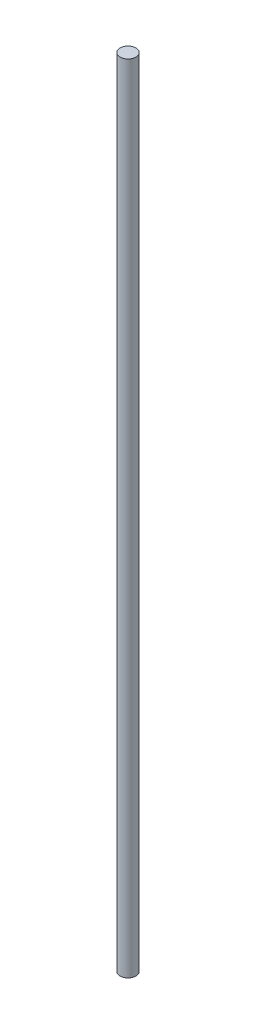
ISO-10303-21;
HEADER;
FILE_DESCRIPTION(('STEP AP214'),'2;1');
FILE_NAME('part.step','',(''),(''),'','','');
FILE_SCHEMA(('AUTOMOTIVE_DESIGN { 1 0 10303 214 1 1 1 1 }'));
ENDSEC;
DATA;
#1=APPLICATION_CONTEXT('core data for automotive mechanical design processes');
#2=APPLICATION_PROTOCOL_DEFINITION('international standard','automotive_design',2000,#1);
#3=PRODUCT_CONTEXT('',#1,'mechanical');
#4=PRODUCT('Part','Part','',(#3));
#5=PRODUCT_RELATED_PRODUCT_CATEGORY('part','',(#4));
#6=PRODUCT_DEFINITION_FORMATION('','',#4);
#7=PRODUCT_DEFINITION_CONTEXT('part definition',#1,'design');
#8=PRODUCT_DEFINITION('design','',#6,#7);
#9=PRODUCT_DEFINITION_SHAPE('','',#8);
#10=(LENGTH_UNIT() NAMED_UNIT(*) SI_UNIT(.MILLI.,.METRE.));
#11=(NAMED_UNIT(*) PLANE_ANGLE_UNIT() SI_UNIT($,.RADIAN.));
#12=(NAMED_UNIT(*) SI_UNIT($,.STERADIAN.) SOLID_ANGLE_UNIT());
#13=UNCERTAINTY_MEASURE_WITH_UNIT(LENGTH_MEASURE(1.E-05),#10,'distance_accuracy_value','');
#14=(GEOMETRIC_REPRESENTATION_CONTEXT(3) GLOBAL_UNCERTAINTY_ASSIGNED_CONTEXT((#13)) GLOBAL_UNIT_ASSIGNED_CONTEXT((#10,
#11,#12)) REPRESENTATION_CONTEXT('',''));
#15=CARTESIAN_POINT('',(0.,0.,0.));
#16=DIRECTION('',(0.,0.,1.));
#17=DIRECTION('',(1.,0.,0.));
#18=AXIS2_PLACEMENT_3D('',#15,#16,#17);
#19=CARTESIAN_POINT('',(0.,300.5,0.));
#20=DIRECTION('',(0.,-1.,0.));
#21=DIRECTION('',(0.,0.,-1.));
#22=AXIS2_PLACEMENT_3D('',#19,#20,#21);
#23=CYLINDRICAL_SURFACE('',#22,3.);
#24=CARTESIAN_POINT('',(0.,300.5,0.));
#25=DIRECTION('',(0.,1.,0.));
#26=DIRECTION('',(0.,0.,1.));
#27=AXIS2_PLACEMENT_3D('',#24,#25,#26);
#28=CIRCLE('',#27,3.);
#29=CARTESIAN_POINT('',(0.,300.5,3.));
#30=VERTEX_POINT('',#29);
#31=EDGE_CURVE('E10',#30,#30,#28,.T.);
#32=ORIENTED_EDGE('',*,*,#31,.F.);
#33=EDGE_LOOP('',(#32));
#34=FACE_BOUND('',#33,.T.);
#35=CARTESIAN_POINT('',(0.,0.,0.));
#36=DIRECTION('',(0.,1.,0.));
#37=DIRECTION('',(0.,0.,1.));
#38=AXIS2_PLACEMENT_3D('',#35,#36,#37);
#39=CIRCLE('',#38,3.);
#40=CARTESIAN_POINT('',(0.,0.,3.));
#41=VERTEX_POINT('',#40);
#42=EDGE_CURVE('E36',#41,#41,#39,.T.);
#43=ORIENTED_EDGE('',*,*,#42,.T.);
#44=EDGE_LOOP('',(#43));
#45=FACE_BOUND('',#44,.T.);
#46=ADVANCED_FACE('F33',(#34,#45),#23,.T.);
#47=CARTESIAN_POINT('',(0.,300.5,0.));
#48=DIRECTION('',(0.,1.,0.));
#49=DIRECTION('',(0.,0.,1.));
#50=AXIS2_PLACEMENT_3D('',#47,#48,#49);
#51=PLANE('',#50);
#52=ORIENTED_EDGE('',*,*,#31,.T.);
#53=EDGE_LOOP('',(#52));
#54=FACE_BOUND('',#53,.T.);
#55=ADVANCED_FACE('F48',(#54),#51,.T.);
#56=CARTESIAN_POINT('',(0.,0.,0.));
#57=DIRECTION('',(0.,1.,0.));
#58=DIRECTION('',(0.,0.,1.));
#59=AXIS2_PLACEMENT_3D('',#56,#57,#58);
#60=PLANE('',#59);
#61=ORIENTED_EDGE('',*,*,#42,.F.);
#62=EDGE_LOOP('',(#61));
#63=FACE_BOUND('',#62,.T.);
#64=ADVANCED_FACE('F46',(#63),#60,.F.);
#65=CLOSED_SHELL('',(#46,#55,#64));
#66=MANIFOLD_SOLID_BREP('B2',#65);
#67=ADVANCED_BREP_SHAPE_REPRESENTATION('',(#18,#66),#14);
#68=SHAPE_DEFINITION_REPRESENTATION(#9,#67);
ENDSEC;
END-ISO-10303-21;
